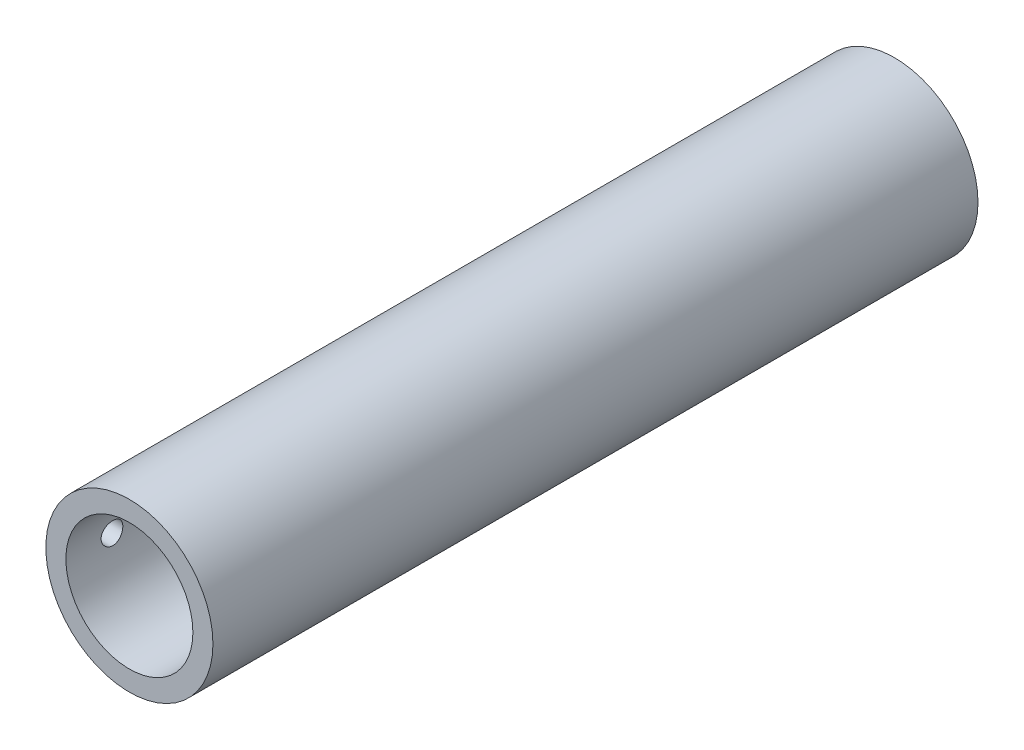
ISO-10303-21;
HEADER;
FILE_DESCRIPTION(('STEP AP214'),'2;1');
FILE_NAME('part.step','',(''),(''),'','','');
FILE_SCHEMA(('AUTOMOTIVE_DESIGN { 1 0 10303 214 1 1 1 1 }'));
ENDSEC;
DATA;
#1=APPLICATION_CONTEXT('core data for automotive mechanical design processes');
#2=APPLICATION_PROTOCOL_DEFINITION('international standard','automotive_design',2000,#1);
#3=PRODUCT_CONTEXT('',#1,'mechanical');
#4=PRODUCT('Part','Part','',(#3));
#5=PRODUCT_RELATED_PRODUCT_CATEGORY('part','',(#4));
#6=PRODUCT_DEFINITION_FORMATION('','',#4);
#7=PRODUCT_DEFINITION_CONTEXT('part definition',#1,'design');
#8=PRODUCT_DEFINITION('design','',#6,#7);
#9=PRODUCT_DEFINITION_SHAPE('','',#8);
#10=(LENGTH_UNIT() NAMED_UNIT(*) SI_UNIT(.MILLI.,.METRE.));
#11=(NAMED_UNIT(*) PLANE_ANGLE_UNIT() SI_UNIT($,.RADIAN.));
#12=(NAMED_UNIT(*) SI_UNIT($,.STERADIAN.) SOLID_ANGLE_UNIT());
#13=UNCERTAINTY_MEASURE_WITH_UNIT(LENGTH_MEASURE(1.E-05),#10,'distance_accuracy_value','');
#14=(GEOMETRIC_REPRESENTATION_CONTEXT(3) GLOBAL_UNCERTAINTY_ASSIGNED_CONTEXT((#13)) GLOBAL_UNIT_ASSIGNED_CONTEXT((#10,
#11,#12)) REPRESENTATION_CONTEXT('',''));
#15=CARTESIAN_POINT('',(0.,0.,0.));
#16=DIRECTION('',(0.,0.,1.));
#17=DIRECTION('',(1.,0.,0.));
#18=AXIS2_PLACEMENT_3D('',#15,#16,#17);
#19=CARTESIAN_POINT('',(0.,0.,116.3));
#20=DIRECTION('',(0.,0.,1.));
#21=DIRECTION('',(1.,0.,0.));
#22=AXIS2_PLACEMENT_3D('',#19,#20,#21);
#23=PLANE('',#22);
#24=CARTESIAN_POINT('',(0.,0.,116.3));
#25=DIRECTION('',(0.,0.,1.));
#26=DIRECTION('',(1.,0.,0.));
#27=AXIS2_PLACEMENT_3D('',#24,#25,#26);
#28=CIRCLE('',#27,12.7);
#29=CARTESIAN_POINT('',(12.7,0.,116.3));
#30=VERTEX_POINT('',#29);
#31=EDGE_CURVE('E10',#30,#30,#28,.T.);
#32=ORIENTED_EDGE('',*,*,#31,.T.);
#33=EDGE_LOOP('',(#32));
#34=FACE_BOUND('',#33,.T.);
#35=CARTESIAN_POINT('',(0.,0.,116.3));
#36=DIRECTION('',(0.,0.,1.));
#37=DIRECTION('',(1.,0.,0.));
#38=AXIS2_PLACEMENT_3D('',#35,#36,#37);
#39=CIRCLE('',#38,9.652);
#40=CARTESIAN_POINT('',(9.652,0.,116.3));
#41=VERTEX_POINT('',#40);
#42=EDGE_CURVE('E49',#41,#41,#39,.T.);
#43=ORIENTED_EDGE('',*,*,#42,.F.);
#44=EDGE_LOOP('',(#43));
#45=FACE_BOUND('',#44,.T.);
#46=ADVANCED_FACE('F30',(#34,#45),#23,.T.);
#47=CARTESIAN_POINT('',(0.,0.,0.));
#48=DIRECTION('',(0.,0.,1.));
#49=DIRECTION('',(1.,0.,0.));
#50=AXIS2_PLACEMENT_3D('',#47,#48,#49);
#51=PLANE('',#50);
#52=CARTESIAN_POINT('',(0.,0.,0.));
#53=DIRECTION('',(0.,0.,1.));
#54=DIRECTION('',(1.,0.,0.));
#55=AXIS2_PLACEMENT_3D('',#52,#53,#54);
#56=CIRCLE('',#55,12.7);
#57=CARTESIAN_POINT('',(12.7,0.,0.));
#58=VERTEX_POINT('',#57);
#59=EDGE_CURVE('E44',#58,#58,#56,.T.);
#60=ORIENTED_EDGE('',*,*,#59,.F.);
#61=EDGE_LOOP('',(#60));
#62=FACE_BOUND('',#61,.T.);
#63=CARTESIAN_POINT('',(0.,0.,0.));
#64=DIRECTION('',(0.,0.,1.));
#65=DIRECTION('',(1.,0.,0.));
#66=AXIS2_PLACEMENT_3D('',#63,#64,#65);
#67=CIRCLE('',#66,9.652);
#68=CARTESIAN_POINT('',(9.652,0.,0.));
#69=VERTEX_POINT('',#68);
#70=EDGE_CURVE('E52',#69,#69,#67,.T.);
#71=ORIENTED_EDGE('',*,*,#70,.T.);
#72=EDGE_LOOP('',(#71));
#73=FACE_BOUND('',#72,.T.);
#74=ADVANCED_FACE('F94',(#62,#73),#51,.F.);
#75=CARTESIAN_POINT('',(0.,0.,116.3));
#76=DIRECTION('',(0.,0.,-1.));
#77=DIRECTION('',(-1.,0.,0.));
#78=AXIS2_PLACEMENT_3D('',#75,#76,#77);
#79=CYLINDRICAL_SURFACE('',#78,12.7);
#80=CARTESIAN_POINT('',(-12.7,0.,19.65));
#81=CARTESIAN_POINT('',(-12.699998671994,-0.0922643236544295,19.6499960993866));
#82=CARTESIAN_POINT('',(-12.698983958577,-0.184585551831701,19.6422350776441));
#83=CARTESIAN_POINT('',(-12.6950336792189,-0.366656916033324,19.6113985477574));
#84=CARTESIAN_POINT('',(-12.6920961323539,-0.456404300819859,19.5883072458417));
#85=CARTESIAN_POINT('',(-12.6846309677445,-0.630665930682718,19.5275037753508));
#86=CARTESIAN_POINT('',(-12.6801044447016,-0.71518373156913,19.4898016708151));
#87=CARTESIAN_POINT('',(-12.6699641706627,-0.876677189933744,19.4008693250264));
#88=CARTESIAN_POINT('',(-12.6643505996702,-0.95365409292974,19.3496413230063));
#89=CARTESIAN_POINT('',(-12.6526253110227,-1.09835248039503,19.2347869029813));
#90=CARTESIAN_POINT('',(-12.6465111134287,-1.16602280747751,19.1710962813662));
#91=CARTESIAN_POINT('',(-12.6344935666052,-1.28974639524778,19.0332624968274));
#92=CARTESIAN_POINT('',(-12.628590228375,-1.34579905063923,18.9591187896218));
#93=CARTESIAN_POINT('',(-12.6176384748391,-1.44488838552917,18.8021488625616));
#94=CARTESIAN_POINT('',(-12.6125932570568,-1.48787683376439,18.7192919537546));
#95=CARTESIAN_POINT('',(-12.6039619389787,-1.5593094185057,18.5474581968473));
#96=CARTESIAN_POINT('',(-12.6003757789891,-1.58775415004512,18.4584815992935));
#97=CARTESIAN_POINT('',(-12.5950924525977,-1.62913573830676,18.2774665801611));
#98=CARTESIAN_POINT('',(-12.5933847384283,-1.64215921967967,18.1854482749958));
#99=CARTESIAN_POINT('',(-12.5920194334868,-1.65259672218689,18.0005175379805));
#100=CARTESIAN_POINT('',(-12.5923617538666,-1.65001141980308,17.9076051450544));
#101=CARTESIAN_POINT('',(-12.595048187675,-1.62937579148491,17.7241288688152));
#102=CARTESIAN_POINT('',(-12.5973799247535,-1.61142107783956,17.6335540249308));
#103=CARTESIAN_POINT('',(-12.6037631561011,-1.5607055639362,17.4567138339631));
#104=CARTESIAN_POINT('',(-12.6078146877641,-1.52794444173763,17.3704485806299));
#105=CARTESIAN_POINT('',(-12.6171949708476,-1.44844392150681,17.2043804162318));
#106=CARTESIAN_POINT('',(-12.6225274916691,-1.40166316722615,17.1245975249262));
#107=CARTESIAN_POINT('',(-12.6338660357438,-1.29548087678776,16.9739782704504));
#108=CARTESIAN_POINT('',(-12.6398720922543,-1.23607871729085,16.9031423494239));
#109=CARTESIAN_POINT('',(-12.6519359349322,-1.10581086214983,16.7718729916681));
#110=CARTESIAN_POINT('',(-12.6579937721697,-1.03486279102087,16.7115212765879));
#111=CARTESIAN_POINT('',(-12.6694366630254,-0.88380016891583,16.6035704482251));
#112=CARTESIAN_POINT('',(-12.6748217148723,-0.803685593808555,16.5559713685154));
#113=CARTESIAN_POINT('',(-12.6843160147836,-0.63649967309915,16.4748761601947));
#114=CARTESIAN_POINT('',(-12.6884247801714,-0.549425711153014,16.4413853654701));
#115=CARTESIAN_POINT('',(-12.6948992577755,-0.370824682195501,16.3895234061737));
#116=CARTESIAN_POINT('',(-12.697265058189,-0.279297840757889,16.371151476554));
#117=CARTESIAN_POINT('',(-12.6999755412598,-0.0950955304063152,16.3501551787095));
#118=CARTESIAN_POINT('',(-12.7003346666506,-0.00243309291156879,16.3474182765857));
#119=CARTESIAN_POINT('',(-12.6990303893535,0.182029172649091,16.357472431121));
#120=CARTESIAN_POINT('',(-12.6973670332797,0.273829020546804,16.3702631299003));
#121=CARTESIAN_POINT('',(-12.6922136724169,0.453626581786285,16.4109158980895));
#122=CARTESIAN_POINT('',(-12.6887301983133,0.541636678825491,16.4387240957699));
#123=CARTESIAN_POINT('',(-12.6803264597727,0.711744460747919,16.508566334189));
#124=CARTESIAN_POINT('',(-12.6754061430132,0.793841930187297,16.5506008929889));
#125=CARTESIAN_POINT('',(-12.6646409367626,0.950295185231418,16.6479734015425));
#126=CARTESIAN_POINT('',(-12.6587910675818,1.02460547698563,16.7033838884147));
#127=CARTESIAN_POINT('',(-12.6468361529216,1.1629116045171,16.8258330336537));
#128=CARTESIAN_POINT('',(-12.6407310964754,1.22690699643533,16.8928721921545));
#129=CARTESIAN_POINT('',(-12.6289090948121,1.34316787630945,17.0371723820807));
#130=CARTESIAN_POINT('',(-12.6231947745924,1.39535861022104,17.114493888558));
#131=CARTESIAN_POINT('',(-12.6128450368234,1.48601166201335,17.2768714872004));
#132=CARTESIAN_POINT('',(-12.608209596199,1.52447427352192,17.3619274138868));
#133=CARTESIAN_POINT('',(-12.6005605644568,1.58645918066333,17.537121581791));
#134=CARTESIAN_POINT('',(-12.5975424576628,1.61002310764714,17.6272448879302));
#135=CARTESIAN_POINT('',(-12.5934570424689,1.64167555648318,17.810211071314));
#136=CARTESIAN_POINT('',(-12.5923896354139,1.6497648609532,17.9030538107841));
#137=CARTESIAN_POINT('',(-12.5923295044501,1.65022329929213,18.0880794669048));
#138=CARTESIAN_POINT('',(-12.5933212793996,1.64270988744748,18.180262109445));
#139=CARTESIAN_POINT('',(-12.5972343720598,1.61242543776057,18.3620422465991));
#140=CARTESIAN_POINT('',(-12.6001556894471,1.58965440247592,18.4516397416462));
#141=CARTESIAN_POINT('',(-12.6075937988727,1.52953872075528,18.6256876277994));
#142=CARTESIAN_POINT('',(-12.6121099196059,1.49220020555893,18.7101401670758));
#143=CARTESIAN_POINT('',(-12.6222298315788,1.40402101075824,18.8716002244482));
#144=CARTESIAN_POINT('',(-12.6278336407552,1.35318010848692,18.9486076197382));
#145=CARTESIAN_POINT('',(-12.6395480159047,1.23900511908698,19.0935912412377));
#146=CARTESIAN_POINT('',(-12.6456619453046,1.17558357087424,19.1614983252901));
#147=CARTESIAN_POINT('',(-12.6576782655565,1.03823082260806,19.2857502994317));
#148=CARTESIAN_POINT('',(-12.6635806063442,0.964297155552046,19.3420924678398));
#149=CARTESIAN_POINT('',(-12.6745356710738,0.807668864253324,19.4418142460819));
#150=CARTESIAN_POINT('',(-12.6795848100563,0.724939541916109,19.4851397277499));
#151=CARTESIAN_POINT('',(-12.6882285390702,0.553358526270597,19.5572202244295));
#152=CARTESIAN_POINT('',(-12.6918246953228,0.464513546845602,19.5859909370196));
#153=CARTESIAN_POINT('',(-12.6962987165773,0.312682965856719,19.6213236033954));
#154=CARTESIAN_POINT('',(-12.6976798697008,0.250651402771433,19.6320616211651));
#155=CARTESIAN_POINT('',(-12.6995309602848,0.125755368432594,19.6464011196012));
#156=CARTESIAN_POINT('',(-12.7000009052199,0.0628909040155512,19.6500026588078));
#157=CARTESIAN_POINT('',(-12.7,0.,19.65));
#158=B_SPLINE_CURVE_WITH_KNOTS('',3,(#80,#81,#82,#83,#84,#85,#86,#87,#88,#89,#90,#91,#92,#93,
#94,#95,#96,#97,#98,#99,#100,#101,#102,#103,#104,#105,#106,#107,#108,#109,#110,#111,#112,#113,
#114,#115,#116,#117,#118,#119,#120,#121,#122,#123,#124,#125,#126,#127,#128,#129,#130,#131,#132,
#133,#134,#135,#136,#137,#138,#139,#140,#141,#142,#143,#144,#145,#146,#147,#148,#149,#150,#151,
#152,#153,#154,#155,#156,#157),.UNSPECIFIED.,.T.,.F.,(4,2,2,2,2,2,2,2,2,2,2,2,2,2,2,2,2,2,2,2,2,
2,2,2,2,2,2,2,2,2,2,2,2,2,2,2,2,2,4),(0.,0.276563234458575,0.553411836748439,0.830070081448885,
1.10668255364166,1.38475946205799,1.66285085501547,1.94195678834349,2.22105130157668,
2.49857052626908,2.77607772341464,3.05187100580365,3.327670285144,3.60429128462151,
3.88092594888515,4.15962857981392,4.43833194445556,4.71714058346983,4.99593511328558,
5.27272045235994,5.54949941221465,5.82529202502768,6.10109468207042,6.37842800235833,
6.65577325335371,6.93482849066395,7.21387775896393,7.49214379394402,7.77039575544941,
8.04656068399889,8.32272556625544,8.59877433991895,8.8748276661675,9.1528719974547,
9.43098168870937,9.71023234573239,9.98918118039051,10.1776988416266,10.3662149564546),.UNSPECIFIED.);
#159=CARTESIAN_POINT('',(-12.7,0.,19.65));
#160=VERTEX_POINT('',#159);
#161=EDGE_CURVE('E153',#160,#160,#158,.T.);
#162=ORIENTED_EDGE('',*,*,#161,.T.);
#163=EDGE_LOOP('',(#162));
#164=FACE_BOUND('',#163,.T.);
#165=CARTESIAN_POINT('',(-12.7,0.,31.45));
#166=CARTESIAN_POINT('',(-12.699998671994,-0.0922643236544294,31.4499960993866));
#167=CARTESIAN_POINT('',(-12.698983958577,-0.184585551831701,31.4422350776441));
#168=CARTESIAN_POINT('',(-12.6950336792189,-0.366656916033324,31.4113985477574));
#169=CARTESIAN_POINT('',(-12.6920961323539,-0.456404300819858,31.3883072458417));
#170=CARTESIAN_POINT('',(-12.6846309677445,-0.630665930682718,31.3275037753508));
#171=CARTESIAN_POINT('',(-12.6801044447016,-0.71518373156913,31.2898016708151));
#172=CARTESIAN_POINT('',(-12.6699641706627,-0.876677189933744,31.2008693250264));
#173=CARTESIAN_POINT('',(-12.6643505996702,-0.95365409292974,31.1496413230063));
#174=CARTESIAN_POINT('',(-12.6526253110227,-1.09835248039503,31.0347869029813));
#175=CARTESIAN_POINT('',(-12.6465111134287,-1.16602280747751,30.9710962813662));
#176=CARTESIAN_POINT('',(-12.6344935666052,-1.28974639524778,30.8332624968274));
#177=CARTESIAN_POINT('',(-12.628590228375,-1.34579905063923,30.7591187896218));
#178=CARTESIAN_POINT('',(-12.6176384748391,-1.44488838552917,30.6021488625616));
#179=CARTESIAN_POINT('',(-12.6125932570568,-1.48787683376439,30.5192919537546));
#180=CARTESIAN_POINT('',(-12.6039619389787,-1.5593094185057,30.3474581968473));
#181=CARTESIAN_POINT('',(-12.6003757789891,-1.58775415004512,30.2584815992935));
#182=CARTESIAN_POINT('',(-12.5950924525977,-1.62913573830676,30.0774665801611));
#183=CARTESIAN_POINT('',(-12.5933847384283,-1.64215921967967,29.9854482749958));
#184=CARTESIAN_POINT('',(-12.5920194334868,-1.65259672218689,29.8005175379805));
#185=CARTESIAN_POINT('',(-12.5923617538666,-1.65001141980308,29.7076051450544));
#186=CARTESIAN_POINT('',(-12.595048187675,-1.62937579148491,29.5241288688152));
#187=CARTESIAN_POINT('',(-12.5973799247535,-1.61142107783956,29.4335540249308));
#188=CARTESIAN_POINT('',(-12.6037631561011,-1.5607055639362,29.2567138339631));
#189=CARTESIAN_POINT('',(-12.6078146877641,-1.52794444173763,29.1704485806299));
#190=CARTESIAN_POINT('',(-12.6171949708476,-1.44844392150681,29.0043804162318));
#191=CARTESIAN_POINT('',(-12.6225274916691,-1.40166316722616,28.9245975249262));
#192=CARTESIAN_POINT('',(-12.6338660357438,-1.29548087678777,28.7739782704504));
#193=CARTESIAN_POINT('',(-12.6398720922543,-1.23607871729085,28.7031423494239));
#194=CARTESIAN_POINT('',(-12.6519359349322,-1.10581086214984,28.5718729916681));
#195=CARTESIAN_POINT('',(-12.6579937721697,-1.03486279102088,28.5115212765879));
#196=CARTESIAN_POINT('',(-12.6694366630254,-0.883800168915834,28.403570448225));
#197=CARTESIAN_POINT('',(-12.6748217148723,-0.803685593808557,28.3559713685154));
#198=CARTESIAN_POINT('',(-12.6843160147836,-0.63649967309915,28.2748761601947));
#199=CARTESIAN_POINT('',(-12.6884247801714,-0.549425711153014,28.2413853654701));
#200=CARTESIAN_POINT('',(-12.6948992577755,-0.370824682195502,28.1895234061737));
#201=CARTESIAN_POINT('',(-12.697265058189,-0.27929784075789,28.171151476554));
#202=CARTESIAN_POINT('',(-12.6999755412598,-0.0950955304063156,28.1501551787095));
#203=CARTESIAN_POINT('',(-12.7003346666506,-0.00243309291156915,28.1474182765857));
#204=CARTESIAN_POINT('',(-12.6990303893535,0.182029172649091,28.157472431121));
#205=CARTESIAN_POINT('',(-12.6973670332797,0.273829020546803,28.1702631299003));
#206=CARTESIAN_POINT('',(-12.6922136724169,0.453626581786285,28.2109158980895));
#207=CARTESIAN_POINT('',(-12.6887301983133,0.541636678825491,28.2387240957699));
#208=CARTESIAN_POINT('',(-12.6803264597727,0.711744460747919,28.308566334189));
#209=CARTESIAN_POINT('',(-12.6754061430132,0.793841930187297,28.3506008929889));
#210=CARTESIAN_POINT('',(-12.6646409367626,0.950295185231418,28.4479734015425));
#211=CARTESIAN_POINT('',(-12.6587910675818,1.02460547698563,28.5033838884147));
#212=CARTESIAN_POINT('',(-12.6468361529216,1.1629116045171,28.6258330336536));
#213=CARTESIAN_POINT('',(-12.6407310964754,1.22690699643533,28.6928721921545));
#214=CARTESIAN_POINT('',(-12.6289090948121,1.34316787630945,28.8371723820807));
#215=CARTESIAN_POINT('',(-12.6231947745924,1.39535861022104,28.9144938885579));
#216=CARTESIAN_POINT('',(-12.6128450368234,1.48601166201335,29.0768714872003));
#217=CARTESIAN_POINT('',(-12.608209596199,1.52447427352192,29.1619274138868));
#218=CARTESIAN_POINT('',(-12.6005605644568,1.58645918066333,29.337121581791));
#219=CARTESIAN_POINT('',(-12.5975424576628,1.61002310764714,29.4272448879302));
#220=CARTESIAN_POINT('',(-12.5934570424689,1.64167555648318,29.6102110713139));
#221=CARTESIAN_POINT('',(-12.5923896354139,1.6497648609532,29.7030538107841));
#222=CARTESIAN_POINT('',(-12.5923295044501,1.65022329929213,29.8880794669048));
#223=CARTESIAN_POINT('',(-12.5933212793996,1.64270988744748,29.980262109445));
#224=CARTESIAN_POINT('',(-12.5972343720598,1.61242543776057,30.1620422465991));
#225=CARTESIAN_POINT('',(-12.6001556894471,1.58965440247592,30.2516397416462));
#226=CARTESIAN_POINT('',(-12.6075937988727,1.52953872075528,30.4256876277994));
#227=CARTESIAN_POINT('',(-12.6121099196059,1.49220020555893,30.5101401670758));
#228=CARTESIAN_POINT('',(-12.6222298315788,1.40402101075824,30.6716002244481));
#229=CARTESIAN_POINT('',(-12.6278336407552,1.35318010848692,30.7486076197381));
#230=CARTESIAN_POINT('',(-12.6395480159047,1.23900511908698,30.8935912412377));
#231=CARTESIAN_POINT('',(-12.6456619453046,1.17558357087424,30.9614983252901));
#232=CARTESIAN_POINT('',(-12.6576782655565,1.03823082260806,31.0857502994317));
#233=CARTESIAN_POINT('',(-12.6635806063442,0.964297155552046,31.1420924678398));
#234=CARTESIAN_POINT('',(-12.6745356710738,0.807668864253324,31.2418142460819));
#235=CARTESIAN_POINT('',(-12.6795848100563,0.72493954191611,31.2851397277499));
#236=CARTESIAN_POINT('',(-12.6882285390702,0.553358526270598,31.3572202244294));
#237=CARTESIAN_POINT('',(-12.6918246953228,0.464513546845604,31.3859909370196));
#238=CARTESIAN_POINT('',(-12.6962987165773,0.312682965856723,31.4213236033954));
#239=CARTESIAN_POINT('',(-12.6976798697008,0.250651402771435,31.4320616211651));
#240=CARTESIAN_POINT('',(-12.6995309602848,0.125755368432595,31.4464011196012));
#241=CARTESIAN_POINT('',(-12.7000009052199,0.062890904015552,31.4500026588078));
#242=CARTESIAN_POINT('',(-12.7,0.,31.45));
#243=B_SPLINE_CURVE_WITH_KNOTS('',3,(#165,#166,#167,#168,#169,#170,#171,#172,#173,#174,#175,
#176,#177,#178,#179,#180,#181,#182,#183,#184,#185,#186,#187,#188,#189,#190,#191,#192,#193,#194,
#195,#196,#197,#198,#199,#200,#201,#202,#203,#204,#205,#206,#207,#208,#209,#210,#211,#212,#213,
#214,#215,#216,#217,#218,#219,#220,#221,#222,#223,#224,#225,#226,#227,#228,#229,#230,#231,#232,
#233,#234,#235,#236,#237,#238,#239,#240,#241,#242),.UNSPECIFIED.,.T.,.F.,(4,2,2,2,2,2,2,2,2,2,2,
2,2,2,2,2,2,2,2,2,2,2,2,2,2,2,2,2,2,2,2,2,2,2,2,2,2,2,4),(0.,0.276563234458575,
0.553411836748439,0.830070081448886,1.10668255364166,1.38475946205799,1.66285085501547,
1.94195678834349,2.22105130157668,2.49857052626908,2.77607772341464,3.05187100580364,
3.327670285144,3.6042912846215,3.88092594888515,4.15962857981391,4.43833194445556,
4.71714058346983,4.99593511328558,5.27272045235994,5.54949941221465,5.82529202502767,
6.10109468207042,6.37842800235833,6.65577325335371,6.93482849066395,7.21387775896393,
7.49214379394402,7.7703957554494,8.04656068399889,8.32272556625544,8.59877433991895,
8.8748276661675,9.1528719974547,9.43098168870937,9.71023234573239,9.9891811803905,
10.1776988416266,10.3662149564546),.UNSPECIFIED.);
#244=CARTESIAN_POINT('',(-12.7,0.,31.45));
#245=VERTEX_POINT('',#244);
#246=EDGE_CURVE('E62',#245,#245,#243,.T.);
#247=ORIENTED_EDGE('',*,*,#246,.T.);
#248=EDGE_LOOP('',(#247));
#249=FACE_BOUND('',#248,.T.);
#250=CARTESIAN_POINT('',(-12.7,0.,110.95));
#251=CARTESIAN_POINT('',(-12.699998671994,-0.0922643236544302,110.949996099387));
#252=CARTESIAN_POINT('',(-12.698983958577,-0.184585551831703,110.942235077644));
#253=CARTESIAN_POINT('',(-12.6950336792189,-0.366656916033327,110.911398547757));
#254=CARTESIAN_POINT('',(-12.6920961323539,-0.456404300819861,110.888307245842));
#255=CARTESIAN_POINT('',(-12.6846309677445,-0.630665930682723,110.827503775351));
#256=CARTESIAN_POINT('',(-12.6801044447016,-0.715183731569136,110.789801670815));
#257=CARTESIAN_POINT('',(-12.6699641706627,-0.876677189933752,110.700869325026));
#258=CARTESIAN_POINT('',(-12.6643505996702,-0.953654092929749,110.649641323006));
#259=CARTESIAN_POINT('',(-12.6526253110227,-1.09835248039504,110.534786902981));
#260=CARTESIAN_POINT('',(-12.6465111134287,-1.16602280747752,110.471096281366));
#261=CARTESIAN_POINT('',(-12.6344935666052,-1.28974639524779,110.333262496827));
#262=CARTESIAN_POINT('',(-12.628590228375,-1.34579905063924,110.259118789622));
#263=CARTESIAN_POINT('',(-12.6176384748391,-1.44488838552918,110.102148862562));
#264=CARTESIAN_POINT('',(-12.6125932570568,-1.4878768337644,110.019291953755));
#265=CARTESIAN_POINT('',(-12.6039619389787,-1.55930941850571,109.847458196847));
#266=CARTESIAN_POINT('',(-12.6003757789891,-1.58775415004513,109.758481599294));
#267=CARTESIAN_POINT('',(-12.5950924525977,-1.62913573830677,109.577466580161));
#268=CARTESIAN_POINT('',(-12.5933847384283,-1.64215921967968,109.485448274996));
#269=CARTESIAN_POINT('',(-12.5920194334868,-1.65259672218691,109.300517537981));
#270=CARTESIAN_POINT('',(-12.5923617538666,-1.6500114198031,109.207605145054));
#271=CARTESIAN_POINT('',(-12.5950481876749,-1.62937579148492,109.024128868815));
#272=CARTESIAN_POINT('',(-12.5973799247535,-1.61142107783958,108.933554024931));
#273=CARTESIAN_POINT('',(-12.6037631561011,-1.56070556393621,108.756713833963));
#274=CARTESIAN_POINT('',(-12.6078146877641,-1.52794444173765,108.67044858063));
#275=CARTESIAN_POINT('',(-12.6171949708476,-1.44844392150683,108.504380416232));
#276=CARTESIAN_POINT('',(-12.6225274916691,-1.40166316722617,108.424597524926));
#277=CARTESIAN_POINT('',(-12.6338660357438,-1.29548087678777,108.27397827045));
#278=CARTESIAN_POINT('',(-12.6398720922543,-1.23607871729086,108.203142349424));
#279=CARTESIAN_POINT('',(-12.6519359349322,-1.10581086214985,108.071872991668));
#280=CARTESIAN_POINT('',(-12.6579937721697,-1.03486279102089,108.011521276588));
#281=CARTESIAN_POINT('',(-12.6694366630254,-0.883800168915846,107.903570448225));
#282=CARTESIAN_POINT('',(-12.6748217148723,-0.803685593808568,107.855971368515));
#283=CARTESIAN_POINT('',(-12.6843160147836,-0.636499673099159,107.774876160195));
#284=CARTESIAN_POINT('',(-12.6884247801714,-0.549425711153022,107.74138536547));
#285=CARTESIAN_POINT('',(-12.6948992577755,-0.370824682195508,107.689523406174));
#286=CARTESIAN_POINT('',(-12.697265058189,-0.279297840757896,107.671151476554));
#287=CARTESIAN_POINT('',(-12.6999755412598,-0.0950955304063196,107.650155178709));
#288=CARTESIAN_POINT('',(-12.7003346666506,-0.00243309291157178,107.647418276586));
#289=CARTESIAN_POINT('',(-12.6990303893535,0.18202917264909,107.657472431121));
#290=CARTESIAN_POINT('',(-12.6973670332797,0.273829020546804,107.6702631299));
#291=CARTESIAN_POINT('',(-12.6922136724169,0.453626581786287,107.71091589809));
#292=CARTESIAN_POINT('',(-12.6887301983133,0.541636678825494,107.73872409577));
#293=CARTESIAN_POINT('',(-12.6803264597727,0.711744460747923,107.808566334189));
#294=CARTESIAN_POINT('',(-12.6754061430132,0.793841930187301,107.850600892989));
#295=CARTESIAN_POINT('',(-12.6646409367626,0.950295185231423,107.947973401542));
#296=CARTESIAN_POINT('',(-12.6587910675818,1.02460547698563,108.003383888415));
#297=CARTESIAN_POINT('',(-12.6468361529216,1.1629116045171,108.125833033654));
#298=CARTESIAN_POINT('',(-12.6407310964754,1.22690699643533,108.192872192154));
#299=CARTESIAN_POINT('',(-12.6289090948121,1.34316787630946,108.337172382081));
#300=CARTESIAN_POINT('',(-12.6231947745924,1.39535861022105,108.414493888558));
#301=CARTESIAN_POINT('',(-12.6128450368234,1.48601166201336,108.5768714872));
#302=CARTESIAN_POINT('',(-12.608209596199,1.52447427352193,108.661927413887));
#303=CARTESIAN_POINT('',(-12.6005605644568,1.58645918066334,108.837121581791));
#304=CARTESIAN_POINT('',(-12.5975424576628,1.61002310764716,108.92724488793));
#305=CARTESIAN_POINT('',(-12.5934570424689,1.6416755564832,109.110211071314));
#306=CARTESIAN_POINT('',(-12.5923896354139,1.64976486095322,109.203053810784));
#307=CARTESIAN_POINT('',(-12.5923295044501,1.65022329929215,109.388079466905));
#308=CARTESIAN_POINT('',(-12.5933212793996,1.64270988744749,109.480262109445));
#309=CARTESIAN_POINT('',(-12.5972343720598,1.61242543776058,109.662042246599));
#310=CARTESIAN_POINT('',(-12.6001556894471,1.58965440247593,109.751639741646));
#311=CARTESIAN_POINT('',(-12.6075937988727,1.52953872075529,109.925687627799));
#312=CARTESIAN_POINT('',(-12.6121099196059,1.49220020555895,110.010140167076));
#313=CARTESIAN_POINT('',(-12.6222298315788,1.40402101075826,110.171600224448));
#314=CARTESIAN_POINT('',(-12.6278336407552,1.35318010848693,110.248607619738));
#315=CARTESIAN_POINT('',(-12.6395480159047,1.23900511908699,110.393591241238));
#316=CARTESIAN_POINT('',(-12.6456619453046,1.17558357087426,110.46149832529));
#317=CARTESIAN_POINT('',(-12.6576782655565,1.03823082260808,110.585750299432));
#318=CARTESIAN_POINT('',(-12.6635806063442,0.964297155552065,110.64209246784));
#319=CARTESIAN_POINT('',(-12.6745356710738,0.807668864253342,110.741814246082));
#320=CARTESIAN_POINT('',(-12.6795848100563,0.724939541916125,110.78513972775));
#321=CARTESIAN_POINT('',(-12.6882285390702,0.553358526270607,110.857220224429));
#322=CARTESIAN_POINT('',(-12.6918246953228,0.464513546845611,110.88599093702));
#323=CARTESIAN_POINT('',(-12.6962987165773,0.312682965856726,110.921323603395));
#324=CARTESIAN_POINT('',(-12.6976798697008,0.250651402771438,110.932061621165));
#325=CARTESIAN_POINT('',(-12.6995309602848,0.125755368432597,110.946401119601));
#326=CARTESIAN_POINT('',(-12.7000009052199,0.0628909040155527,110.950002658808));
#327=CARTESIAN_POINT('',(-12.7,0.,110.95));
#328=B_SPLINE_CURVE_WITH_KNOTS('',3,(#250,#251,#252,#253,#254,#255,#256,#257,#258,#259,#260,
#261,#262,#263,#264,#265,#266,#267,#268,#269,#270,#271,#272,#273,#274,#275,#276,#277,#278,#279,
#280,#281,#282,#283,#284,#285,#286,#287,#288,#289,#290,#291,#292,#293,#294,#295,#296,#297,#298,
#299,#300,#301,#302,#303,#304,#305,#306,#307,#308,#309,#310,#311,#312,#313,#314,#315,#316,#317,
#318,#319,#320,#321,#322,#323,#324,#325,#326,#327),.UNSPECIFIED.,.T.,.F.,(4,2,2,2,2,2,2,2,2,2,2,
2,2,2,2,2,2,2,2,2,2,2,2,2,2,2,2,2,2,2,2,2,2,2,2,2,2,2,4),(0.,0.276563234458577,
0.553411836748443,0.830070081448891,1.10668255364167,1.384759462058,1.66285085501548,
1.9419567883435,2.22105130157671,2.4985705262691,2.77607772341466,3.05187100580367,
3.32767028514404,3.60429128462154,3.88092594888518,4.15962857981395,4.4383319444556,
4.71714058346987,4.99593511328562,5.27272045235999,5.5494994122147,5.82529202502773,
6.10109468207047,6.37842800235838,6.65577325335377,6.934828490664,7.21387775896399,
7.4921437939441,7.77039575544948,8.04656068399896,8.32272556625552,8.59877433991903,
8.87482766616757,9.15287199745477,9.43098168870944,9.71023234573247,9.9891811803906,
10.1776988416267,10.3662149564547),.UNSPECIFIED.);
#329=CARTESIAN_POINT('',(-12.7,0.,110.95));
#330=VERTEX_POINT('',#329);
#331=EDGE_CURVE('E61',#330,#330,#328,.T.);
#332=ORIENTED_EDGE('',*,*,#331,.T.);
#333=EDGE_LOOP('',(#332));
#334=FACE_BOUND('',#333,.T.);
#335=ORIENTED_EDGE('',*,*,#31,.F.);
#336=EDGE_LOOP('',(#335));
#337=FACE_BOUND('',#336,.T.);
#338=ORIENTED_EDGE('',*,*,#59,.T.);
#339=EDGE_LOOP('',(#338));
#340=FACE_BOUND('',#339,.T.);
#341=ADVANCED_FACE('F32',(#164,#249,#334,#337,#340),#79,.T.);
#342=CARTESIAN_POINT('',(0.,0.,116.3));
#343=DIRECTION('',(0.,0.,-1.));
#344=DIRECTION('',(-1.,0.,0.));
#345=AXIS2_PLACEMENT_3D('',#342,#343,#344);
#346=CYLINDRICAL_SURFACE('',#345,9.652);
#347=CARTESIAN_POINT('',(-9.652,0.,19.65));
#348=CARTESIAN_POINT('',(-9.65199840216458,-0.0919628298950399,19.6499963442051));
#349=CARTESIAN_POINT('',(-9.65067202077969,-0.183974975733299,19.642285696692));
#350=CARTESIAN_POINT('',(-9.64550856906842,-0.365416216560566,19.6116610359921));
#351=CARTESIAN_POINT('',(-9.64166922727953,-0.454842898116841,19.5887332678014));
#352=CARTESIAN_POINT('',(-9.63191026175016,-0.628462082575436,19.5283888549681));
#353=CARTESIAN_POINT('',(-9.62599237510193,-0.712658887281701,19.4909843062826));
#354=CARTESIAN_POINT('',(-9.61272612998453,-0.873571323084405,19.4027803212136));
#355=CARTESIAN_POINT('',(-9.6053779256647,-0.950287759024988,19.35198232807));
#356=CARTESIAN_POINT('',(-9.58998249057883,-1.09484183582372,19.2378913384956));
#357=CARTESIAN_POINT('',(-9.58192957275087,-1.1625935158486,19.174490184964));
#358=CARTESIAN_POINT('',(-9.56607559102252,-1.28655210158152,19.0372253809964));
#359=CARTESIAN_POINT('',(-9.55827454345983,-1.34275825964655,18.9633610535288));
#360=CARTESIAN_POINT('',(-9.54375245958461,-1.44237739281358,18.8066727719618));
#361=CARTESIAN_POINT('',(-9.53703876906818,-1.48570488183152,18.7237937272709));
#362=CARTESIAN_POINT('',(-9.52553070601754,-1.55778998734419,18.5517998528044));
#363=CARTESIAN_POINT('',(-9.52073619689182,-1.5865486407674,18.4626854673396));
#364=CARTESIAN_POINT('',(-9.51366609249079,-1.62840788137453,18.2816634946021));
#365=CARTESIAN_POINT('',(-9.51136658980216,-1.64165717945919,18.1897912465686));
#366=CARTESIAN_POINT('',(-9.50947458614889,-1.65258279108199,18.0051010741469));
#367=CARTESIAN_POINT('',(-9.5098818836415,-1.65026026406594,17.9122832206805));
#368=CARTESIAN_POINT('',(-9.51333564476736,-1.63022917580694,17.7294012524156));
#369=CARTESIAN_POINT('',(-9.51635338401971,-1.61268806825615,17.6393181747397));
#370=CARTESIAN_POINT('',(-9.5246430122262,-1.5629807199128,17.4633927147069));
#371=CARTESIAN_POINT('',(-9.52991498215219,-1.53081395376466,17.3775504848045));
#372=CARTESIAN_POINT('',(-9.54214988630303,-1.45259979767748,17.2120443941199));
#373=CARTESIAN_POINT('',(-9.54912121098604,-1.40648325063483,17.132413861082));
#374=CARTESIAN_POINT('',(-9.56396356327337,-1.30172767465342,16.9819579718597));
#375=CARTESIAN_POINT('',(-9.57183466715562,-1.2430875836767,16.9111333632533));
#376=CARTESIAN_POINT('',(-9.58771571229775,-1.11403899573683,16.7793308184365));
#377=CARTESIAN_POINT('',(-9.59572612494008,-1.04348691121893,16.7184934388086));
#378=CARTESIAN_POINT('',(-9.61088837959566,-0.893101655559594,16.6094989408758));
#379=CARTESIAN_POINT('',(-9.61804021552919,-0.813268418704748,16.5613419123597));
#380=CARTESIAN_POINT('',(-9.63069044852088,-0.646452038458769,16.4790607852603));
#381=CARTESIAN_POINT('',(-9.63618733049777,-0.559462435724765,16.4449495349019));
#382=CARTESIAN_POINT('',(-9.64489624222869,-0.380873814913822,16.3918609772476));
#383=CARTESIAN_POINT('',(-9.64810847319769,-0.289275203524936,16.3728823371666));
#384=CARTESIAN_POINT('',(-9.65185898058014,-0.105279742819779,16.3507892749333));
#385=CARTESIAN_POINT('',(-9.65242976558138,-0.012906693328753,16.3474819715928));
#386=CARTESIAN_POINT('',(-9.65092225675758,0.171073382960651,16.3563106171026));
#387=CARTESIAN_POINT('',(-9.64884407035734,0.262680440670963,16.368445939702));
#388=CARTESIAN_POINT('',(-9.64229227443341,0.441929224742529,16.4076549382122));
#389=CARTESIAN_POINT('',(-9.63783404921964,0.529592540638017,16.4346327080306));
#390=CARTESIAN_POINT('',(-9.62702002815444,0.699152095093055,16.5026582590518));
#391=CARTESIAN_POINT('',(-9.62066412118924,0.781047995609692,16.5437068641561));
#392=CARTESIAN_POINT('',(-9.60667902250342,0.937582943180906,16.6391476990865));
#393=CARTESIAN_POINT('',(-9.59903859179688,1.01214781970716,16.6936598988938));
#394=CARTESIAN_POINT('',(-9.58336480300499,1.15114041897502,16.8143160248646));
#395=CARTESIAN_POINT('',(-9.57533141483094,1.21556736385866,16.8804608427459));
#396=CARTESIAN_POINT('',(-9.55967146555244,1.33317377360685,17.0233713200184));
#397=CARTESIAN_POINT('',(-9.5520503086572,1.38622265279268,17.1002451298476));
#398=CARTESIAN_POINT('',(-9.53818013887627,1.47865386602208,17.2619262673959));
#399=CARTESIAN_POINT('',(-9.53193108088812,1.51803664931043,17.3467333342091));
#400=CARTESIAN_POINT('',(-9.52155357076309,1.58182440984125,17.5215151107658));
#401=CARTESIAN_POINT('',(-9.51741607194088,1.60629337245159,17.6114659070489));
#402=CARTESIAN_POINT('',(-9.51170783169745,1.63975953560043,17.7942778195752));
#403=CARTESIAN_POINT('',(-9.51013685432296,1.64875815840924,17.8871386674828));
#404=CARTESIAN_POINT('',(-9.50975005747882,1.65098696703414,18.0718299667722));
#405=CARTESIAN_POINT('',(-9.51089830967865,1.64442277809946,18.1636579259101));
#406=CARTESIAN_POINT('',(-9.51574166961122,1.61615801622239,18.3448820269979));
#407=CARTESIAN_POINT('',(-9.5194367678263,1.59445749984509,18.4342781780342));
#408=CARTESIAN_POINT('',(-9.52894352803493,1.53661645706931,18.6080153926153));
#409=CARTESIAN_POINT('',(-9.53475246210317,1.50049453582126,18.6923628089629));
#410=CARTESIAN_POINT('',(-9.54783486255095,1.41485741668422,18.8538334894313));
#411=CARTESIAN_POINT('',(-9.55510840773296,1.36534149809062,18.930956364513));
#412=CARTESIAN_POINT('',(-9.57041392781059,1.2535918078549,19.0768259036186));
#413=CARTESIAN_POINT('',(-9.57845423313256,1.1912070677228,19.145456054873));
#414=CARTESIAN_POINT('',(-9.5943217177416,1.05580836016939,19.271343826572));
#415=CARTESIAN_POINT('',(-9.6021488474848,0.982791946458919,19.3285988224679));
#416=CARTESIAN_POINT('',(-9.61677451224209,0.827567447241628,19.4304951139892));
#417=CARTESIAN_POINT('',(-9.62356511637525,0.745296117803574,19.4750412192706));
#418=CARTESIAN_POINT('',(-9.63527544103631,0.574354004243485,19.5496114188607));
#419=CARTESIAN_POINT('',(-9.64019700320525,0.48568962251423,19.5796498161633));
#420=CARTESIAN_POINT('',(-9.64655446014133,0.330580321675195,19.6179139545702));
#421=CARTESIAN_POINT('',(-9.6485855028236,0.265067943735504,19.6299267021844));
#422=CARTESIAN_POINT('',(-9.65130883827116,0.133045636432329,19.6459709728497));
#423=CARTESIAN_POINT('',(-9.65200115604467,0.0665357257267747,19.6500026449922));
#424=CARTESIAN_POINT('',(-9.652,0.,19.65));
#425=B_SPLINE_CURVE_WITH_KNOTS('',3,(#347,#348,#349,#350,#351,#352,#353,#354,#355,#356,#357,
#358,#359,#360,#361,#362,#363,#364,#365,#366,#367,#368,#369,#370,#371,#372,#373,#374,#375,#376,
#377,#378,#379,#380,#381,#382,#383,#384,#385,#386,#387,#388,#389,#390,#391,#392,#393,#394,#395,
#396,#397,#398,#399,#400,#401,#402,#403,#404,#405,#406,#407,#408,#409,#410,#411,#412,#413,#414,
#415,#416,#417,#418,#419,#420,#421,#422,#423,#424),.UNSPECIFIED.,.T.,.F.,(4,2,2,2,2,2,2,2,2,2,2,
2,2,2,2,2,2,2,2,2,2,2,2,2,2,2,2,2,2,2,2,2,2,2,2,2,2,2,4),(0.,0.275645259643975,
0.551540019497062,0.827204753641873,1.1028397950613,1.38095118956939,1.65908058781413,
1.93901691575258,2.21893331658388,2.49614317437115,2.77333239191669,3.04750976437629,
3.32169698610149,3.59726643194244,3.87285925627045,4.15204847033646,4.43123966126798,
4.7106856750204,4.99010707420856,5.26608029131873,5.54204231713155,5.81624177742898,
6.09045729590248,6.36721047751499,6.64398488335865,6.9237834266561,7.20357277128059,
7.48215311584047,7.76070784766337,8.03560269876312,8.3104965225746,8.58503684413007,
8.85959194109895,9.1375725724483,9.41561726697254,9.69569291186285,9.975491866648,
10.1749267908637,10.3743579894739),.UNSPECIFIED.);
#426=CARTESIAN_POINT('',(-9.652,0.,19.65));
#427=VERTEX_POINT('',#426);
#428=EDGE_CURVE('E35',#427,#427,#425,.T.);
#429=ORIENTED_EDGE('',*,*,#428,.F.);
#430=EDGE_LOOP('',(#429));
#431=FACE_BOUND('',#430,.T.);
#432=CARTESIAN_POINT('',(-9.652,0.,31.45));
#433=CARTESIAN_POINT('',(-9.65199840216458,-0.0919628298950397,31.4499963442051));
#434=CARTESIAN_POINT('',(-9.65067202077969,-0.183974975733299,31.442285696692));
#435=CARTESIAN_POINT('',(-9.64550856906842,-0.365416216560566,31.4116610359921));
#436=CARTESIAN_POINT('',(-9.64166922727953,-0.454842898116841,31.3887332678014));
#437=CARTESIAN_POINT('',(-9.63191026175016,-0.628462082575436,31.3283888549681));
#438=CARTESIAN_POINT('',(-9.62599237510193,-0.712658887281703,31.2909843062826));
#439=CARTESIAN_POINT('',(-9.61272612998453,-0.873571323084408,31.2027803212136));
#440=CARTESIAN_POINT('',(-9.6053779256647,-0.95028775902499,31.15198232807));
#441=CARTESIAN_POINT('',(-9.58998249057883,-1.09484183582372,31.0378913384956));
#442=CARTESIAN_POINT('',(-9.58192957275087,-1.1625935158486,30.974490184964));
#443=CARTESIAN_POINT('',(-9.56607559102252,-1.28655210158152,30.8372253809964));
#444=CARTESIAN_POINT('',(-9.55827454345983,-1.34275825964655,30.7633610535288));
#445=CARTESIAN_POINT('',(-9.54375245958461,-1.44237739281358,30.6066727719618));
#446=CARTESIAN_POINT('',(-9.53703876906818,-1.48570488183152,30.5237937272709));
#447=CARTESIAN_POINT('',(-9.52553070601754,-1.55778998734419,30.3517998528044));
#448=CARTESIAN_POINT('',(-9.52073619689182,-1.5865486407674,30.2626854673396));
#449=CARTESIAN_POINT('',(-9.51366609249079,-1.62840788137453,30.0816634946021));
#450=CARTESIAN_POINT('',(-9.51136658980216,-1.64165717945919,29.9897912465686));
#451=CARTESIAN_POINT('',(-9.50947458614889,-1.65258279108199,29.8051010741469));
#452=CARTESIAN_POINT('',(-9.5098818836415,-1.65026026406594,29.7122832206805));
#453=CARTESIAN_POINT('',(-9.51333564476736,-1.63022917580694,29.5294012524156));
#454=CARTESIAN_POINT('',(-9.51635338401971,-1.61268806825615,29.4393181747397));
#455=CARTESIAN_POINT('',(-9.5246430122262,-1.5629807199128,29.2633927147069));
#456=CARTESIAN_POINT('',(-9.52991498215219,-1.53081395376466,29.1775504848045));
#457=CARTESIAN_POINT('',(-9.54214988630303,-1.45259979767748,29.0120443941199));
#458=CARTESIAN_POINT('',(-9.54912121098604,-1.40648325063483,28.932413861082));
#459=CARTESIAN_POINT('',(-9.56396356327337,-1.30172767465342,28.7819579718597));
#460=CARTESIAN_POINT('',(-9.57183466715562,-1.2430875836767,28.7111333632533));
#461=CARTESIAN_POINT('',(-9.58771571229775,-1.11403899573682,28.5793308184365));
#462=CARTESIAN_POINT('',(-9.59572612494008,-1.04348691121893,28.5184934388085));
#463=CARTESIAN_POINT('',(-9.61088837959566,-0.893101655559595,28.4094989408758));
#464=CARTESIAN_POINT('',(-9.61804021552919,-0.813268418704747,28.3613419123597));
#465=CARTESIAN_POINT('',(-9.63069044852088,-0.646452038458768,28.2790607852602));
#466=CARTESIAN_POINT('',(-9.63618733049777,-0.559462435724765,28.2449495349019));
#467=CARTESIAN_POINT('',(-9.64489624222869,-0.380873814913821,28.1918609772476));
#468=CARTESIAN_POINT('',(-9.64810847319769,-0.289275203524935,28.1728823371666));
#469=CARTESIAN_POINT('',(-9.65185898058014,-0.105279742819778,28.1507892749333));
#470=CARTESIAN_POINT('',(-9.65242976558138,-0.0129066933287522,28.1474819715928));
#471=CARTESIAN_POINT('',(-9.65092225675758,0.171073382960651,28.1563106171026));
#472=CARTESIAN_POINT('',(-9.64884407035734,0.262680440670963,28.168445939702));
#473=CARTESIAN_POINT('',(-9.64229227443341,0.44192922474253,28.2076549382122));
#474=CARTESIAN_POINT('',(-9.63783404921964,0.529592540638018,28.2346327080306));
#475=CARTESIAN_POINT('',(-9.62702002815444,0.699152095093056,28.3026582590518));
#476=CARTESIAN_POINT('',(-9.62066412118924,0.781047995609693,28.3437068641561));
#477=CARTESIAN_POINT('',(-9.60667902250342,0.937582943180907,28.4391476990865));
#478=CARTESIAN_POINT('',(-9.59903859179688,1.01214781970716,28.4936598988938));
#479=CARTESIAN_POINT('',(-9.58336480300499,1.15114041897502,28.6143160248646));
#480=CARTESIAN_POINT('',(-9.57533141483094,1.21556736385866,28.6804608427459));
#481=CARTESIAN_POINT('',(-9.55967146555244,1.33317377360685,28.8233713200184));
#482=CARTESIAN_POINT('',(-9.5520503086572,1.38622265279268,28.9002451298476));
#483=CARTESIAN_POINT('',(-9.53818013887627,1.47865386602208,29.0619262673959));
#484=CARTESIAN_POINT('',(-9.53193108088812,1.51803664931043,29.1467333342091));
#485=CARTESIAN_POINT('',(-9.52155357076309,1.58182440984125,29.3215151107658));
#486=CARTESIAN_POINT('',(-9.51741607194088,1.60629337245159,29.4114659070489));
#487=CARTESIAN_POINT('',(-9.51170783169745,1.63975953560043,29.5942778195752));
#488=CARTESIAN_POINT('',(-9.51013685432296,1.64875815840924,29.6871386674827));
#489=CARTESIAN_POINT('',(-9.50975005747882,1.65098696703414,29.8718299667722));
#490=CARTESIAN_POINT('',(-9.51089830967865,1.64442277809946,29.9636579259101));
#491=CARTESIAN_POINT('',(-9.51574166961122,1.61615801622239,30.1448820269979));
#492=CARTESIAN_POINT('',(-9.5194367678263,1.59445749984509,30.2342781780342));
#493=CARTESIAN_POINT('',(-9.52894352803494,1.53661645706931,30.4080153926153));
#494=CARTESIAN_POINT('',(-9.53475246210317,1.50049453582126,30.4923628089629));
#495=CARTESIAN_POINT('',(-9.54783486255095,1.41485741668422,30.6538334894313));
#496=CARTESIAN_POINT('',(-9.55510840773296,1.36534149809062,30.730956364513));
#497=CARTESIAN_POINT('',(-9.57041392781059,1.2535918078549,30.8768259036186));
#498=CARTESIAN_POINT('',(-9.57845423313256,1.1912070677228,30.945456054873));
#499=CARTESIAN_POINT('',(-9.5943217177416,1.05580836016939,31.071343826572));
#500=CARTESIAN_POINT('',(-9.6021488474848,0.982791946458918,31.1285988224679));
#501=CARTESIAN_POINT('',(-9.61677451224209,0.827567447241627,31.2304951139892));
#502=CARTESIAN_POINT('',(-9.62356511637525,0.745296117803571,31.2750412192706));
#503=CARTESIAN_POINT('',(-9.63527544103631,0.574354004243482,31.3496114188607));
#504=CARTESIAN_POINT('',(-9.64019700320525,0.485689622514229,31.3796498161633));
#505=CARTESIAN_POINT('',(-9.64655446014133,0.330580321675195,31.4179139545701));
#506=CARTESIAN_POINT('',(-9.6485855028236,0.265067943735503,31.4299267021844));
#507=CARTESIAN_POINT('',(-9.65130883827116,0.133045636432329,31.4459709728497));
#508=CARTESIAN_POINT('',(-9.65200115604467,0.0665357257267745,31.4500026449922));
#509=CARTESIAN_POINT('',(-9.652,0.,31.45));
#510=B_SPLINE_CURVE_WITH_KNOTS('',3,(#432,#433,#434,#435,#436,#437,#438,#439,#440,#441,#442,
#443,#444,#445,#446,#447,#448,#449,#450,#451,#452,#453,#454,#455,#456,#457,#458,#459,#460,#461,
#462,#463,#464,#465,#466,#467,#468,#469,#470,#471,#472,#473,#474,#475,#476,#477,#478,#479,#480,
#481,#482,#483,#484,#485,#486,#487,#488,#489,#490,#491,#492,#493,#494,#495,#496,#497,#498,#499,
#500,#501,#502,#503,#504,#505,#506,#507,#508,#509),.UNSPECIFIED.,.T.,.F.,(4,2,2,2,2,2,2,2,2,2,2,
2,2,2,2,2,2,2,2,2,2,2,2,2,2,2,2,2,2,2,2,2,2,2,2,2,2,2,4),(0.,0.275645259643975,
0.551540019497063,0.827204753641877,1.1028397950613,1.38095118956939,1.65908058781413,
1.93901691575258,2.21893331658388,2.49614317437114,2.77333239191668,3.04750976437628,
3.32169698610148,3.59726643194244,3.87285925627045,4.15204847033646,4.43123966126798,
4.7106856750204,4.99010707420856,5.26608029131873,5.54204231713155,5.81624177742898,
6.09045729590247,6.36721047751499,6.64398488335865,6.9237834266561,7.20357277128059,
7.48215311584047,7.76070784766337,8.03560269876312,8.3104965225746,8.58503684413007,
8.85959194109895,9.1375725724483,9.41561726697254,9.69569291186286,9.975491866648,
10.1749267908637,10.3743579894739),.UNSPECIFIED.);
#511=CARTESIAN_POINT('',(-9.652,0.,31.45));
#512=VERTEX_POINT('',#511);
#513=EDGE_CURVE('E63',#512,#512,#510,.T.);
#514=ORIENTED_EDGE('',*,*,#513,.F.);
#515=EDGE_LOOP('',(#514));
#516=FACE_BOUND('',#515,.T.);
#517=CARTESIAN_POINT('',(-9.652,0.,110.95));
#518=CARTESIAN_POINT('',(-9.65199840216458,-0.0919628298950416,110.949996344205));
#519=CARTESIAN_POINT('',(-9.65067202077969,-0.183974975733302,110.942285696692));
#520=CARTESIAN_POINT('',(-9.64550856906842,-0.365416216560571,110.911661035992));
#521=CARTESIAN_POINT('',(-9.64166922727953,-0.454842898116846,110.888733267801));
#522=CARTESIAN_POINT('',(-9.63191026175016,-0.628462082575441,110.828388854968));
#523=CARTESIAN_POINT('',(-9.62599237510193,-0.712658887281707,110.790984306283));
#524=CARTESIAN_POINT('',(-9.61272612998453,-0.873571323084414,110.702780321214));
#525=CARTESIAN_POINT('',(-9.6053779256647,-0.950287759025,110.65198232807));
#526=CARTESIAN_POINT('',(-9.58998249057883,-1.09484183582373,110.537891338496));
#527=CARTESIAN_POINT('',(-9.58192957275087,-1.16259351584861,110.474490184964));
#528=CARTESIAN_POINT('',(-9.56607559102252,-1.28655210158152,110.337225380996));
#529=CARTESIAN_POINT('',(-9.55827454345983,-1.34275825964656,110.263361053529));
#530=CARTESIAN_POINT('',(-9.54375245958461,-1.44237739281359,110.106672771962));
#531=CARTESIAN_POINT('',(-9.53703876906818,-1.48570488183153,110.023793727271));
#532=CARTESIAN_POINT('',(-9.52553070601754,-1.55778998734421,109.851799852804));
#533=CARTESIAN_POINT('',(-9.52073619689182,-1.58654864076742,109.76268546734));
#534=CARTESIAN_POINT('',(-9.51366609249078,-1.62840788137454,109.581663494602));
#535=CARTESIAN_POINT('',(-9.51136658980215,-1.6416571794592,109.489791246569));
#536=CARTESIAN_POINT('',(-9.50947458614888,-1.65258279108201,109.305101074147));
#537=CARTESIAN_POINT('',(-9.5098818836415,-1.65026026406595,109.21228322068));
#538=CARTESIAN_POINT('',(-9.51333564476736,-1.63022917580696,109.029401252416));
#539=CARTESIAN_POINT('',(-9.51635338401971,-1.61268806825616,108.93931817474));
#540=CARTESIAN_POINT('',(-9.52464301222619,-1.56298071991281,108.763392714707));
#541=CARTESIAN_POINT('',(-9.52991498215219,-1.53081395376467,108.677550484804));
#542=CARTESIAN_POINT('',(-9.54214988630303,-1.45259979767749,108.51204439412));
#543=CARTESIAN_POINT('',(-9.54912121098604,-1.40648325063484,108.432413861082));
#544=CARTESIAN_POINT('',(-9.56396356327337,-1.30172767465343,108.28195797186));
#545=CARTESIAN_POINT('',(-9.57183466715562,-1.24308758367671,108.211133363253));
#546=CARTESIAN_POINT('',(-9.58771571229775,-1.11403899573684,108.079330818436));
#547=CARTESIAN_POINT('',(-9.59572612494008,-1.04348691121895,108.018493438809));
#548=CARTESIAN_POINT('',(-9.61088837959566,-0.89310165555961,107.909498940876));
#549=CARTESIAN_POINT('',(-9.61804021552919,-0.813268418704758,107.86134191236));
#550=CARTESIAN_POINT('',(-9.63069044852088,-0.646452038458775,107.77906078526));
#551=CARTESIAN_POINT('',(-9.63618733049777,-0.559462435724772,107.744949534902));
#552=CARTESIAN_POINT('',(-9.64489624222869,-0.380873814913826,107.691860977248));
#553=CARTESIAN_POINT('',(-9.6481084731977,-0.289275203524937,107.672882337167));
#554=CARTESIAN_POINT('',(-9.65185898058014,-0.105279742819777,107.650789274933));
#555=CARTESIAN_POINT('',(-9.65242976558138,-0.0129066933287501,107.647481971593));
#556=CARTESIAN_POINT('',(-9.65092225675758,0.171073382960654,107.656310617103));
#557=CARTESIAN_POINT('',(-9.64884407035734,0.262680440670965,107.668445939702));
#558=CARTESIAN_POINT('',(-9.64229227443341,0.441929224742534,107.707654938212));
#559=CARTESIAN_POINT('',(-9.63783404921964,0.529592540638024,107.734632708031));
#560=CARTESIAN_POINT('',(-9.62702002815444,0.699152095093062,107.802658259052));
#561=CARTESIAN_POINT('',(-9.62066412118924,0.781047995609698,107.843706864156));
#562=CARTESIAN_POINT('',(-9.60667902250342,0.937582943180913,107.939147699086));
#563=CARTESIAN_POINT('',(-9.59903859179688,1.01214781970717,107.993659898894));
#564=CARTESIAN_POINT('',(-9.58336480300499,1.15114041897503,108.114316024865));
#565=CARTESIAN_POINT('',(-9.57533141483094,1.21556736385868,108.180460842746));
#566=CARTESIAN_POINT('',(-9.55967146555244,1.33317377360686,108.323371320018));
#567=CARTESIAN_POINT('',(-9.5520503086572,1.38622265279269,108.400245129848));
#568=CARTESIAN_POINT('',(-9.53818013887626,1.47865386602209,108.561926267396));
#569=CARTESIAN_POINT('',(-9.53193108088812,1.51803664931044,108.646733334209));
#570=CARTESIAN_POINT('',(-9.52155357076308,1.58182440984127,108.821515110766));
#571=CARTESIAN_POINT('',(-9.51741607194088,1.60629337245161,108.911465907049));
#572=CARTESIAN_POINT('',(-9.51170783169744,1.63975953560045,109.094277819575));
#573=CARTESIAN_POINT('',(-9.51013685432296,1.64875815840925,109.187138667483));
#574=CARTESIAN_POINT('',(-9.50975005747882,1.65098696703416,109.371829966772));
#575=CARTESIAN_POINT('',(-9.51089830967865,1.64442277809948,109.46365792591));
#576=CARTESIAN_POINT('',(-9.51574166961122,1.6161580162224,109.644882026998));
#577=CARTESIAN_POINT('',(-9.5194367678263,1.59445749984511,109.734278178034));
#578=CARTESIAN_POINT('',(-9.52894352803493,1.53661645706933,109.908015392615));
#579=CARTESIAN_POINT('',(-9.53475246210317,1.50049453582127,109.992362808963));
#580=CARTESIAN_POINT('',(-9.54783486255095,1.41485741668423,110.153833489431));
#581=CARTESIAN_POINT('',(-9.55510840773296,1.36534149809064,110.230956364513));
#582=CARTESIAN_POINT('',(-9.57041392781059,1.25359180785491,110.376825903619));
#583=CARTESIAN_POINT('',(-9.57845423313256,1.19120706772282,110.445456054873));
#584=CARTESIAN_POINT('',(-9.5943217177416,1.0558083601694,110.571343826572));
#585=CARTESIAN_POINT('',(-9.6021488474848,0.98279194645893,110.628598822468));
#586=CARTESIAN_POINT('',(-9.61677451224209,0.827567447241638,110.730495113989));
#587=CARTESIAN_POINT('',(-9.62356511637525,0.745296117803582,110.775041219271));
#588=CARTESIAN_POINT('',(-9.63527544103631,0.574354004243489,110.849611418861));
#589=CARTESIAN_POINT('',(-9.64019700320525,0.485689622514231,110.879649816163));
#590=CARTESIAN_POINT('',(-9.64655446014133,0.330580321675194,110.91791395457));
#591=CARTESIAN_POINT('',(-9.6485855028236,0.265067943735503,110.929926702184));
#592=CARTESIAN_POINT('',(-9.65130883827116,0.133045636432329,110.94597097285));
#593=CARTESIAN_POINT('',(-9.65200115604467,0.0665357257267743,110.950002644992));
#594=CARTESIAN_POINT('',(-9.652,0.,110.95));
#595=B_SPLINE_CURVE_WITH_KNOTS('',3,(#517,#518,#519,#520,#521,#522,#523,#524,#525,#526,#527,
#528,#529,#530,#531,#532,#533,#534,#535,#536,#537,#538,#539,#540,#541,#542,#543,#544,#545,#546,
#547,#548,#549,#550,#551,#552,#553,#554,#555,#556,#557,#558,#559,#560,#561,#562,#563,#564,#565,
#566,#567,#568,#569,#570,#571,#572,#573,#574,#575,#576,#577,#578,#579,#580,#581,#582,#583,#584,
#585,#586,#587,#588,#589,#590,#591,#592,#593,#594),.UNSPECIFIED.,.T.,.F.,(4,2,2,2,2,2,2,2,2,2,2,
2,2,2,2,2,2,2,2,2,2,2,2,2,2,2,2,2,2,2,2,2,2,2,2,2,2,2,4),(0.,0.275645259643979,
0.551540019497067,0.827204753641882,1.10283979506131,1.3809511895694,1.65908058781413,
1.93901691575259,2.21893331658391,2.49614317437116,2.77333239191671,3.0475097643763,
3.32169698610152,3.59726643194247,3.87285925627047,4.15204847033648,4.43123966126801,
4.71068567502043,4.9901070742086,5.26608029131878,5.5420423171316,5.81624177742903,
6.09045729590253,6.36721047751504,6.64398488335871,6.92378342665615,7.20357277128064,
7.48215311584055,7.76070784766345,8.0356026987632,8.31049652257465,8.58503684413013,
8.85959194109902,9.13757257244837,9.41561726697261,9.69569291186294,9.97549186664808,
10.1749267908638,10.374357989474),.UNSPECIFIED.);
#596=CARTESIAN_POINT('',(-9.652,0.,110.95));
#597=VERTEX_POINT('',#596);
#598=EDGE_CURVE('E55',#597,#597,#595,.T.);
#599=ORIENTED_EDGE('',*,*,#598,.F.);
#600=EDGE_LOOP('',(#599));
#601=FACE_BOUND('',#600,.T.);
#602=ORIENTED_EDGE('',*,*,#42,.T.);
#603=EDGE_LOOP('',(#602));
#604=FACE_BOUND('',#603,.T.);
#605=ORIENTED_EDGE('',*,*,#70,.F.);
#606=EDGE_LOOP('',(#605));
#607=FACE_BOUND('',#606,.T.);
#608=ADVANCED_FACE('F68',(#431,#516,#601,#604,#607),#346,.F.);
#609=CARTESIAN_POINT('',(-30.,0.,109.3));
#610=DIRECTION('',(1.,0.,0.));
#611=DIRECTION('',(0.,0.,-1.));
#612=AXIS2_PLACEMENT_3D('',#609,#610,#611);
#613=CYLINDRICAL_SURFACE('',#612,1.65000000000002);
#614=ORIENTED_EDGE('',*,*,#598,.T.);
#615=EDGE_LOOP('',(#614));
#616=FACE_BOUND('',#615,.T.);
#617=ORIENTED_EDGE('',*,*,#331,.F.);
#618=EDGE_LOOP('',(#617));
#619=FACE_BOUND('',#618,.T.);
#620=ADVANCED_FACE('F71',(#616,#619),#613,.F.);
#621=CARTESIAN_POINT('',(-30.,0.,29.8));
#622=DIRECTION('',(1.,0.,0.));
#623=DIRECTION('',(0.,0.,-1.));
#624=AXIS2_PLACEMENT_3D('',#621,#622,#623);
#625=CYLINDRICAL_SURFACE('',#624,1.65);
#626=ORIENTED_EDGE('',*,*,#513,.T.);
#627=EDGE_LOOP('',(#626));
#628=FACE_BOUND('',#627,.T.);
#629=ORIENTED_EDGE('',*,*,#246,.F.);
#630=EDGE_LOOP('',(#629));
#631=FACE_BOUND('',#630,.T.);
#632=ADVANCED_FACE('F74',(#628,#631),#625,.F.);
#633=CARTESIAN_POINT('',(-30.,0.,18.));
#634=DIRECTION('',(1.,0.,0.));
#635=DIRECTION('',(0.,0.,-1.));
#636=AXIS2_PLACEMENT_3D('',#633,#634,#635);
#637=CYLINDRICAL_SURFACE('',#636,1.65);
#638=ORIENTED_EDGE('',*,*,#428,.T.);
#639=EDGE_LOOP('',(#638));
#640=FACE_BOUND('',#639,.T.);
#641=ORIENTED_EDGE('',*,*,#161,.F.);
#642=EDGE_LOOP('',(#641));
#643=FACE_BOUND('',#642,.T.);
#644=ADVANCED_FACE('F137',(#640,#643),#637,.F.);
#645=CLOSED_SHELL('',(#46,#74,#341,#608,#620,#632,#644));
#646=MANIFOLD_SOLID_BREP('B2',#645);
#647=ADVANCED_BREP_SHAPE_REPRESENTATION('',(#18,#646),#14);
#648=SHAPE_DEFINITION_REPRESENTATION(#9,#647);
ENDSEC;
END-ISO-10303-21;
